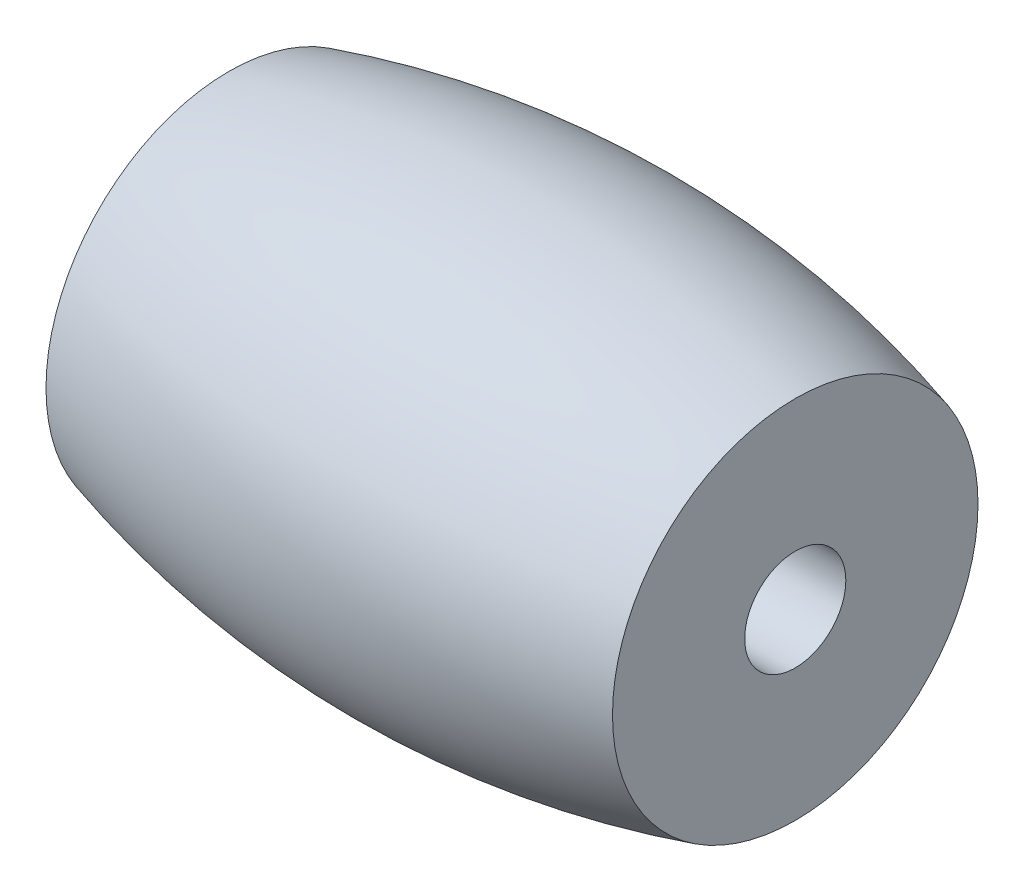
ISO-10303-21;
HEADER;
FILE_DESCRIPTION(('STEP AP214'),'2;1');
FILE_NAME('part.step','',(''),(''),'','','');
FILE_SCHEMA(('AUTOMOTIVE_DESIGN { 1 0 10303 214 1 1 1 1 }'));
ENDSEC;
DATA;
#1=APPLICATION_CONTEXT('core data for automotive mechanical design processes');
#2=APPLICATION_PROTOCOL_DEFINITION('international standard','automotive_design',2000,#1);
#3=PRODUCT_CONTEXT('',#1,'mechanical');
#4=PRODUCT('Part','Part','',(#3));
#5=PRODUCT_RELATED_PRODUCT_CATEGORY('part','',(#4));
#6=PRODUCT_DEFINITION_FORMATION('','',#4);
#7=PRODUCT_DEFINITION_CONTEXT('part definition',#1,'design');
#8=PRODUCT_DEFINITION('design','',#6,#7);
#9=PRODUCT_DEFINITION_SHAPE('','',#8);
#10=(LENGTH_UNIT() NAMED_UNIT(*) SI_UNIT(.MILLI.,.METRE.));
#11=(NAMED_UNIT(*) PLANE_ANGLE_UNIT() SI_UNIT($,.RADIAN.));
#12=(NAMED_UNIT(*) SI_UNIT($,.STERADIAN.) SOLID_ANGLE_UNIT());
#13=UNCERTAINTY_MEASURE_WITH_UNIT(LENGTH_MEASURE(1.E-05),#10,'distance_accuracy_value','');
#14=(GEOMETRIC_REPRESENTATION_CONTEXT(3) GLOBAL_UNCERTAINTY_ASSIGNED_CONTEXT((#13)) GLOBAL_UNIT_ASSIGNED_CONTEXT((#10,
#11,#12)) REPRESENTATION_CONTEXT('',''));
#15=CARTESIAN_POINT('',(0.,0.,0.));
#16=DIRECTION('',(0.,0.,1.));
#17=DIRECTION('',(1.,0.,0.));
#18=AXIS2_PLACEMENT_3D('',#15,#16,#17);
#19=CARTESIAN_POINT('',(6.99999999999999,15.383612060749,0.));
#20=DIRECTION('',(-1.,0.,0.));
#21=DIRECTION('',(0.,0.,1.));
#22=AXIS2_PLACEMENT_3D('',#19,#20,#21);
#23=PLANE('',#22);
#24=CARTESIAN_POINT('',(6.99999999999999,19.9,0.));
#25=DIRECTION('',(1.,0.,0.));
#26=DIRECTION('',(0.,0.,-1.));
#27=AXIS2_PLACEMENT_3D('',#24,#25,#26);
#28=CIRCLE('',#27,1.25);
#29=CARTESIAN_POINT('',(6.99999999999999,19.9,-1.25));
#30=VERTEX_POINT('',#29);
#31=EDGE_CURVE('E45',#30,#30,#28,.T.);
#32=ORIENTED_EDGE('',*,*,#31,.F.);
#33=EDGE_LOOP('',(#32));
#34=FACE_BOUND('',#33,.T.);
#35=CARTESIAN_POINT('',(6.99999999999998,19.9,0.));
#36=DIRECTION('',(1.,0.,0.));
#37=DIRECTION('',(0.,0.,-1.));
#38=AXIS2_PLACEMENT_3D('',#35,#36,#37);
#39=CIRCLE('',#38,4.51638793925098);
#40=CARTESIAN_POINT('',(6.99999999999998,19.9,-4.51638793925098));
#41=VERTEX_POINT('',#40);
#42=EDGE_CURVE('E39',#41,#41,#39,.T.);
#43=ORIENTED_EDGE('',*,*,#42,.T.);
#44=EDGE_LOOP('',(#43));
#45=FACE_BOUND('',#44,.T.);
#46=ADVANCED_FACE('F32',(#34,#45),#23,.F.);
#47=CARTESIAN_POINT('',(-7.,15.383612060749,0.));
#48=DIRECTION('',(1.,0.,0.));
#49=DIRECTION('',(0.,0.,-1.));
#50=AXIS2_PLACEMENT_3D('',#47,#48,#49);
#51=PLANE('',#50);
#52=CARTESIAN_POINT('',(-7.,19.9,0.));
#53=DIRECTION('',(1.,0.,0.));
#54=DIRECTION('',(0.,0.,-1.));
#55=AXIS2_PLACEMENT_3D('',#52,#53,#54);
#56=CIRCLE('',#55,1.25);
#57=CARTESIAN_POINT('',(-7.,19.9,-1.25));
#58=VERTEX_POINT('',#57);
#59=EDGE_CURVE('E35',#58,#58,#56,.T.);
#60=ORIENTED_EDGE('',*,*,#59,.T.);
#61=EDGE_LOOP('',(#60));
#62=FACE_BOUND('',#61,.T.);
#63=CARTESIAN_POINT('',(-7.,19.9,0.));
#64=DIRECTION('',(1.,0.,0.));
#65=DIRECTION('',(0.,0.,-1.));
#66=AXIS2_PLACEMENT_3D('',#63,#64,#65);
#67=CIRCLE('',#66,4.51638793925097);
#68=CARTESIAN_POINT('',(-7.,19.9,-4.51638793925097));
#69=VERTEX_POINT('',#68);
#70=EDGE_CURVE('E10',#69,#69,#67,.T.);
#71=ORIENTED_EDGE('',*,*,#70,.F.);
#72=EDGE_LOOP('',(#71));
#73=FACE_BOUND('',#72,.T.);
#74=ADVANCED_FACE('F52',(#62,#73),#51,.F.);
#75=CARTESIAN_POINT('',(0.,19.9,0.));
#76=DIRECTION('',(1.,0.,0.));
#77=DIRECTION('',(0.,0.,-1.));
#78=AXIS2_PLACEMENT_3D('',#75,#76,#77);
#79=DEGENERATE_TOROIDAL_SURFACE('',#78,19.9,25.4,.F.);
#80=ORIENTED_EDGE('',*,*,#42,.F.);
#81=EDGE_LOOP('',(#80));
#82=FACE_BOUND('',#81,.T.);
#83=ORIENTED_EDGE('',*,*,#70,.T.);
#84=EDGE_LOOP('',(#83));
#85=FACE_BOUND('',#84,.T.);
#86=ADVANCED_FACE('F57',(#82,#85),#79,.F.);
#87=CARTESIAN_POINT('',(-11.,19.9,0.));
#88=DIRECTION('',(1.,0.,0.));
#89=DIRECTION('',(0.,0.,-1.));
#90=AXIS2_PLACEMENT_3D('',#87,#88,#89);
#91=CYLINDRICAL_SURFACE('',#90,1.25);
#92=ORIENTED_EDGE('',*,*,#31,.T.);
#93=EDGE_LOOP('',(#92));
#94=FACE_BOUND('',#93,.T.);
#95=ORIENTED_EDGE('',*,*,#59,.F.);
#96=EDGE_LOOP('',(#95));
#97=FACE_BOUND('',#96,.T.);
#98=ADVANCED_FACE('F55',(#94,#97),#91,.F.);
#99=CLOSED_SHELL('',(#46,#74,#86,#98));
#100=MANIFOLD_SOLID_BREP('B2',#99);
#101=ADVANCED_BREP_SHAPE_REPRESENTATION('',(#18,#100),#14);
#102=SHAPE_DEFINITION_REPRESENTATION(#9,#101);
ENDSEC;
END-ISO-10303-21;
